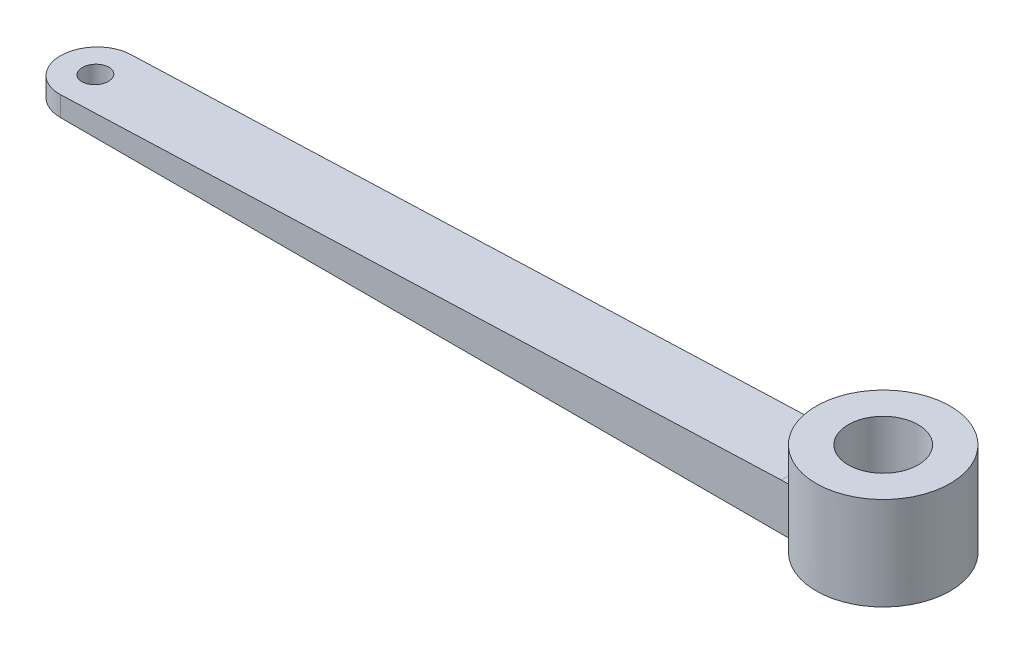
ISO-10303-21;
HEADER;
FILE_DESCRIPTION(('STEP AP214'),'2;1');
FILE_NAME('part.step','',(''),(''),'','','');
FILE_SCHEMA(('AUTOMOTIVE_DESIGN { 1 0 10303 214 1 1 1 1 }'));
ENDSEC;
DATA;
#1=APPLICATION_CONTEXT('core data for automotive mechanical design processes');
#2=APPLICATION_PROTOCOL_DEFINITION('international standard','automotive_design',2000,#1);
#3=PRODUCT_CONTEXT('',#1,'mechanical');
#4=PRODUCT('Part','Part','',(#3));
#5=PRODUCT_RELATED_PRODUCT_CATEGORY('part','',(#4));
#6=PRODUCT_DEFINITION_FORMATION('','',#4);
#7=PRODUCT_DEFINITION_CONTEXT('part definition',#1,'design');
#8=PRODUCT_DEFINITION('design','',#6,#7);
#9=PRODUCT_DEFINITION_SHAPE('','',#8);
#10=(LENGTH_UNIT() NAMED_UNIT(*) SI_UNIT(.MILLI.,.METRE.));
#11=(NAMED_UNIT(*) PLANE_ANGLE_UNIT() SI_UNIT($,.RADIAN.));
#12=(NAMED_UNIT(*) SI_UNIT($,.STERADIAN.) SOLID_ANGLE_UNIT());
#13=UNCERTAINTY_MEASURE_WITH_UNIT(LENGTH_MEASURE(1.E-05),#10,'distance_accuracy_value','');
#14=(GEOMETRIC_REPRESENTATION_CONTEXT(3) GLOBAL_UNCERTAINTY_ASSIGNED_CONTEXT((#13)) GLOBAL_UNIT_ASSIGNED_CONTEXT((#10,
#11,#12)) REPRESENTATION_CONTEXT('',''));
#15=CARTESIAN_POINT('',(0.,0.,0.));
#16=DIRECTION('',(0.,0.,1.));
#17=DIRECTION('',(1.,0.,0.));
#18=AXIS2_PLACEMENT_3D('',#15,#16,#17);
#19=CARTESIAN_POINT('',(0.,6.35,0.));
#20=DIRECTION('',(0.,1.,0.));
#21=DIRECTION('',(0.,0.,1.));
#22=AXIS2_PLACEMENT_3D('',#19,#20,#21);
#23=PLANE('',#22);
#24=DIRECTION('',(0.,0.,-1.));
#25=VECTOR('',#24,1.);
#26=CARTESIAN_POINT('',(-9.14399999999999,6.35,0.));
#27=LINE('',#26,#25);
#28=CARTESIAN_POINT('',(-9.144,6.35,4.76250000000001));
#29=VERTEX_POINT('',#28);
#30=CARTESIAN_POINT('',(-9.14399999999999,6.35,0.));
#31=VERTEX_POINT('',#30);
#32=EDGE_CURVE('E11',#29,#31,#27,.T.);
#33=ORIENTED_EDGE('',*,*,#32,.F.);
#34=DIRECTION('',(-1.,0.,0.));
#35=VECTOR('',#34,1.);
#36=CARTESIAN_POINT('',(0.,6.35,4.7625));
#37=LINE('',#36,#35);
#38=CARTESIAN_POINT('',(-7.80585227569674,6.35,4.7625));
#39=VERTEX_POINT('',#38);
#40=EDGE_CURVE('E114',#39,#29,#37,.T.);
#41=ORIENTED_EDGE('',*,*,#40,.F.);
#42=CARTESIAN_POINT('',(0.,6.35,0.));
#43=DIRECTION('',(0.,1.,0.));
#44=DIRECTION('',(0.,0.,1.));
#45=AXIS2_PLACEMENT_3D('',#42,#43,#44);
#46=CIRCLE('',#45,9.144);
#47=EDGE_CURVE('E63',#31,#39,#46,.T.);
#48=ORIENTED_EDGE('',*,*,#47,.F.);
#49=EDGE_LOOP('',(#33,#41,#48));
#50=FACE_BOUND('',#49,.T.);
#51=ADVANCED_FACE('F41',(#50),#23,.T.);
#52=CARTESIAN_POINT('',(0.,12.7,0.));
#53=DIRECTION('',(0.,1.,0.));
#54=DIRECTION('',(0.,0.,1.));
#55=AXIS2_PLACEMENT_3D('',#52,#53,#54);
#56=PLANE('',#55);
#57=CARTESIAN_POINT('',(0.,12.7,0.));
#58=DIRECTION('',(0.,1.,0.));
#59=DIRECTION('',(0.,0.,1.));
#60=AXIS2_PLACEMENT_3D('',#57,#58,#59);
#61=CIRCLE('',#60,9.144);
#62=CARTESIAN_POINT('',(0.,12.7,9.144));
#63=VERTEX_POINT('',#62);
#64=EDGE_CURVE('E99',#63,#63,#61,.T.);
#65=ORIENTED_EDGE('',*,*,#64,.T.);
#66=EDGE_LOOP('',(#65));
#67=FACE_BOUND('',#66,.T.);
#68=CARTESIAN_POINT('',(0.,12.7,0.));
#69=DIRECTION('',(0.,1.,0.));
#70=DIRECTION('',(0.,0.,1.));
#71=AXIS2_PLACEMENT_3D('',#68,#69,#70);
#72=CIRCLE('',#71,4.7625);
#73=CARTESIAN_POINT('',(0.,12.7,4.7625));
#74=VERTEX_POINT('',#73);
#75=EDGE_CURVE('E150',#74,#74,#72,.T.);
#76=ORIENTED_EDGE('',*,*,#75,.F.);
#77=EDGE_LOOP('',(#76));
#78=FACE_BOUND('',#77,.T.);
#79=ADVANCED_FACE('F195',(#67,#78),#56,.T.);
#80=CARTESIAN_POINT('',(0.,0.,0.));
#81=DIRECTION('',(0.,1.,0.));
#82=DIRECTION('',(0.,0.,1.));
#83=AXIS2_PLACEMENT_3D('',#80,#81,#82);
#84=PLANE('',#83);
#85=CARTESIAN_POINT('',(0.,0.,0.));
#86=DIRECTION('',(0.,1.,0.));
#87=DIRECTION('',(0.,0.,1.));
#88=AXIS2_PLACEMENT_3D('',#85,#86,#87);
#89=CIRCLE('',#88,4.7625);
#90=CARTESIAN_POINT('',(0.,0.,4.7625));
#91=VERTEX_POINT('',#90);
#92=EDGE_CURVE('E149',#91,#91,#89,.T.);
#93=ORIENTED_EDGE('',*,*,#92,.T.);
#94=EDGE_LOOP('',(#93));
#95=FACE_BOUND('',#94,.T.);
#96=CARTESIAN_POINT('',(0.,0.,0.));
#97=DIRECTION('',(0.,1.,0.));
#98=DIRECTION('',(0.,0.,1.));
#99=AXIS2_PLACEMENT_3D('',#96,#97,#98);
#100=CIRCLE('',#99,9.144);
#101=CARTESIAN_POINT('',(-7.80585227569674,0.,4.7625));
#102=VERTEX_POINT('',#101);
#103=CARTESIAN_POINT('',(-7.80585227569674,0.,-4.7625));
#104=VERTEX_POINT('',#103);
#105=EDGE_CURVE('E154',#102,#104,#100,.T.);
#106=ORIENTED_EDGE('',*,*,#105,.F.);
#107=DIRECTION('',(-1.,0.,0.));
#108=VECTOR('',#107,1.);
#109=CARTESIAN_POINT('',(0.,0.,4.7625));
#110=LINE('',#109,#108);
#111=CARTESIAN_POINT('',(-107.442,0.,4.76250000000001));
#112=VERTEX_POINT('',#111);
#113=EDGE_CURVE('E129',#102,#112,#110,.T.);
#114=ORIENTED_EDGE('',*,*,#113,.T.);
#115=CARTESIAN_POINT('',(-107.442,0.,0.));
#116=DIRECTION('',(0.,1.,0.));
#117=DIRECTION('',(0.,0.,1.));
#118=AXIS2_PLACEMENT_3D('',#115,#116,#117);
#119=CIRCLE('',#118,4.7625);
#120=CARTESIAN_POINT('',(-107.442,0.,-4.76249999999999));
#121=VERTEX_POINT('',#120);
#122=EDGE_CURVE('E125',#112,#121,#119,.F.);
#123=ORIENTED_EDGE('',*,*,#122,.T.);
#124=DIRECTION('',(-1.,0.,0.));
#125=VECTOR('',#124,1.);
#126=CARTESIAN_POINT('',(0.,0.,-4.7625));
#127=LINE('',#126,#125);
#128=EDGE_CURVE('E133',#104,#121,#127,.T.);
#129=ORIENTED_EDGE('',*,*,#128,.F.);
#130=EDGE_LOOP('',(#106,#114,#123,#129));
#131=FACE_BOUND('',#130,.T.);
#132=CARTESIAN_POINT('',(-107.442,0.,0.));
#133=DIRECTION('',(0.,1.,0.));
#134=DIRECTION('',(0.,0.,1.));
#135=AXIS2_PLACEMENT_3D('',#132,#133,#134);
#136=CIRCLE('',#135,1.77800000000001);
#137=CARTESIAN_POINT('',(-107.442,0.,1.77800000000001));
#138=VERTEX_POINT('',#137);
#139=EDGE_CURVE('E121',#138,#138,#136,.T.);
#140=ORIENTED_EDGE('',*,*,#139,.T.);
#141=EDGE_LOOP('',(#140));
#142=FACE_BOUND('',#141,.T.);
#143=ADVANCED_FACE('F165',(#95,#131,#142),#84,.F.);
#144=CARTESIAN_POINT('',(0.,12.7,0.));
#145=DIRECTION('',(0.,-1.,0.));
#146=DIRECTION('',(0.,0.,-1.));
#147=AXIS2_PLACEMENT_3D('',#144,#145,#146);
#148=CYLINDRICAL_SURFACE('',#147,9.144);
#149=CARTESIAN_POINT('',(-7.80585227569674,6.35,-4.7625));
#150=VERTEX_POINT('',#149);
#151=EDGE_CURVE('E112',#150,#31,#46,.T.);
#152=ORIENTED_EDGE('',*,*,#151,.T.);
#153=ORIENTED_EDGE('',*,*,#47,.T.);
#154=DIRECTION('',(0.,-1.,0.));
#155=VECTOR('',#154,1.);
#156=CARTESIAN_POINT('',(-7.80585227569674,12.7,4.7625));
#157=LINE('',#156,#155);
#158=EDGE_CURVE('E146',#39,#102,#157,.T.);
#159=ORIENTED_EDGE('',*,*,#158,.T.);
#160=ORIENTED_EDGE('',*,*,#105,.T.);
#161=DIRECTION('',(0.,-1.,0.));
#162=VECTOR('',#161,1.);
#163=CARTESIAN_POINT('',(-7.80585227569674,12.7,-4.7625));
#164=LINE('',#163,#162);
#165=EDGE_CURVE('E143',#150,#104,#164,.T.);
#166=ORIENTED_EDGE('',*,*,#165,.F.);
#167=EDGE_LOOP('',(#152,#153,#159,#160,#166));
#168=FACE_BOUND('',#167,.T.);
#169=ORIENTED_EDGE('',*,*,#64,.F.);
#170=EDGE_LOOP('',(#169));
#171=FACE_BOUND('',#170,.T.);
#172=ADVANCED_FACE('F43',(#168,#171),#148,.T.);
#173=CARTESIAN_POINT('',(0.,12.7,0.));
#174=DIRECTION('',(0.,-1.,0.));
#175=DIRECTION('',(0.,0.,-1.));
#176=AXIS2_PLACEMENT_3D('',#173,#174,#175);
#177=CYLINDRICAL_SURFACE('',#176,4.7625);
#178=ORIENTED_EDGE('',*,*,#92,.F.);
#179=EDGE_LOOP('',(#178));
#180=FACE_BOUND('',#179,.T.);
#181=ORIENTED_EDGE('',*,*,#75,.T.);
#182=EDGE_LOOP('',(#181));
#183=FACE_BOUND('',#182,.T.);
#184=ADVANCED_FACE('F184',(#180,#183),#177,.F.);
#185=CARTESIAN_POINT('',(0.,6.35,4.7625));
#186=DIRECTION('',(0.,0.,1.));
#187=DIRECTION('',(1.,0.,0.));
#188=AXIS2_PLACEMENT_3D('',#185,#186,#187);
#189=PLANE('',#188);
#190=DIRECTION('',(0.999317361797155,0.0369433405470298,0.));
#191=VECTOR('',#190,1.);
#192=CARTESIAN_POINT('',(-0.0124798263961151,6.68757930401493,4.7625));
#193=LINE('',#192,#191);
#194=CARTESIAN_POINT('',(-107.442,2.71606284658041,4.76250000000001));
#195=VERTEX_POINT('',#194);
#196=EDGE_CURVE('E108',#195,#29,#193,.T.);
#197=ORIENTED_EDGE('',*,*,#196,.F.);
#198=DIRECTION('',(0.,-1.,0.));
#199=VECTOR('',#198,1.);
#200=CARTESIAN_POINT('',(-107.442,6.35,4.76250000000001));
#201=LINE('',#200,#199);
#202=EDGE_CURVE('E118',#195,#112,#201,.T.);
#203=ORIENTED_EDGE('',*,*,#202,.T.);
#204=ORIENTED_EDGE('',*,*,#113,.F.);
#205=ORIENTED_EDGE('',*,*,#158,.F.);
#206=ORIENTED_EDGE('',*,*,#40,.T.);
#207=EDGE_LOOP('',(#197,#203,#204,#205,#206));
#208=FACE_BOUND('',#207,.T.);
#209=ADVANCED_FACE('F182',(#208),#189,.T.);
#210=CARTESIAN_POINT('',(0.,6.35,-4.7625));
#211=DIRECTION('',(0.,0.,1.));
#212=DIRECTION('',(1.,0.,0.));
#213=AXIS2_PLACEMENT_3D('',#210,#211,#212);
#214=PLANE('',#213);
#215=DIRECTION('',(0.,-1.,0.));
#216=VECTOR('',#215,1.);
#217=CARTESIAN_POINT('',(-107.442,6.35,-4.76249999999999));
#218=LINE('',#217,#216);
#219=CARTESIAN_POINT('',(-107.442,2.71606284658041,-4.76249999999999));
#220=VERTEX_POINT('',#219);
#221=EDGE_CURVE('E106',#220,#121,#218,.T.);
#222=ORIENTED_EDGE('',*,*,#221,.F.);
#223=DIRECTION('',(0.999317361797155,0.0369433405470298,0.));
#224=VECTOR('',#223,1.);
#225=CARTESIAN_POINT('',(-0.0124798263961163,6.68757930401493,-4.7625));
#226=LINE('',#225,#224);
#227=CARTESIAN_POINT('',(-9.144,6.35,-4.7625));
#228=VERTEX_POINT('',#227);
#229=EDGE_CURVE('E93',#220,#228,#226,.T.);
#230=ORIENTED_EDGE('',*,*,#229,.T.);
#231=DIRECTION('',(-1.,0.,0.));
#232=VECTOR('',#231,1.);
#233=CARTESIAN_POINT('',(0.,6.35,-4.7625));
#234=LINE('',#233,#232);
#235=EDGE_CURVE('E104',#150,#228,#234,.T.);
#236=ORIENTED_EDGE('',*,*,#235,.F.);
#237=ORIENTED_EDGE('',*,*,#165,.T.);
#238=ORIENTED_EDGE('',*,*,#128,.T.);
#239=EDGE_LOOP('',(#222,#230,#236,#237,#238));
#240=FACE_BOUND('',#239,.T.);
#241=ADVANCED_FACE('F102',(#240),#214,.F.);
#242=CARTESIAN_POINT('',(-107.442,6.35,0.));
#243=DIRECTION('',(0.,-1.,0.));
#244=DIRECTION('',(0.,0.,-1.));
#245=AXIS2_PLACEMENT_3D('',#242,#243,#244);
#246=CYLINDRICAL_SURFACE('',#245,4.7625);
#247=CARTESIAN_POINT('',(-107.442,2.71606284658041,0.));
#248=DIRECTION('',(0.0369433405470298,-0.999317361797155,0.));
#249=DIRECTION('',(-0.999317361797155,-0.0369433405470298,0.));
#250=AXIS2_PLACEMENT_3D('',#247,#248,#249);
#251=ELLIPSE('',#250,4.76575328525785,4.7625);
#252=EDGE_CURVE('E109',#220,#195,#251,.F.);
#253=ORIENTED_EDGE('',*,*,#252,.F.);
#254=ORIENTED_EDGE('',*,*,#221,.T.);
#255=ORIENTED_EDGE('',*,*,#122,.F.);
#256=ORIENTED_EDGE('',*,*,#202,.F.);
#257=EDGE_LOOP('',(#253,#254,#255,#256));
#258=FACE_BOUND('',#257,.T.);
#259=ADVANCED_FACE('F170',(#258),#246,.T.);
#260=CARTESIAN_POINT('',(-107.442,6.35,0.));
#261=DIRECTION('',(0.,-1.,0.));
#262=DIRECTION('',(0.,0.,-1.));
#263=AXIS2_PLACEMENT_3D('',#260,#261,#262);
#264=CYLINDRICAL_SURFACE('',#263,1.77800000000001);
#265=CARTESIAN_POINT('',(-107.442,2.71606284658041,0.));
#266=DIRECTION('',(0.0369433405470298,-0.999317361797155,0.));
#267=DIRECTION('',(-0.999317361797155,-0.0369433405470298,0.));
#268=AXIS2_PLACEMENT_3D('',#265,#266,#267);
#269=ELLIPSE('',#268,1.7792145598296,1.77800000000001);
#270=CARTESIAN_POINT('',(-109.22,2.65033271719039,0.));
#271=VERTEX_POINT('',#270);
#272=EDGE_CURVE('E173',#271,#271,#269,.T.);
#273=ORIENTED_EDGE('',*,*,#272,.F.);
#274=EDGE_LOOP('',(#273));
#275=FACE_BOUND('',#274,.T.);
#276=ORIENTED_EDGE('',*,*,#139,.F.);
#277=EDGE_LOOP('',(#276));
#278=FACE_BOUND('',#277,.T.);
#279=ADVANCED_FACE('F205',(#275,#278),#264,.F.);
#280=EDGE_CURVE('E45',#31,#228,#27,.T.);
#281=ORIENTED_EDGE('',*,*,#280,.F.);
#282=ORIENTED_EDGE('',*,*,#151,.F.);
#283=ORIENTED_EDGE('',*,*,#235,.T.);
#284=EDGE_LOOP('',(#281,#282,#283));
#285=FACE_BOUND('',#284,.T.);
#286=ADVANCED_FACE('F111',(#285),#23,.T.);
#287=CARTESIAN_POINT('',(-0.246909898628707,6.67891275790652,-9.144));
#288=DIRECTION('',(0.0369433405470298,-0.999317361797155,0.));
#289=DIRECTION('',(0.999317361797155,0.0369433405470298,0.));
#290=AXIS2_PLACEMENT_3D('',#287,#288,#289);
#291=PLANE('',#290);
#292=ORIENTED_EDGE('',*,*,#196,.T.);
#293=ORIENTED_EDGE('',*,*,#32,.T.);
#294=ORIENTED_EDGE('',*,*,#280,.T.);
#295=ORIENTED_EDGE('',*,*,#229,.F.);
#296=ORIENTED_EDGE('',*,*,#252,.T.);
#297=EDGE_LOOP('',(#292,#293,#294,#295,#296));
#298=FACE_BOUND('',#297,.T.);
#299=ORIENTED_EDGE('',*,*,#272,.T.);
#300=EDGE_LOOP('',(#299));
#301=FACE_BOUND('',#300,.T.);
#302=ADVANCED_FACE('F91',(#298,#301),#291,.F.);
#303=CLOSED_SHELL('',(#51,#79,#143,#172,#184,#209,#241,#259,#279,#286,#302));
#304=MANIFOLD_SOLID_BREP('B2',#303);
#305=ADVANCED_BREP_SHAPE_REPRESENTATION('',(#18,#304),#14);
#306=SHAPE_DEFINITION_REPRESENTATION(#9,#305);
ENDSEC;
END-ISO-10303-21;
